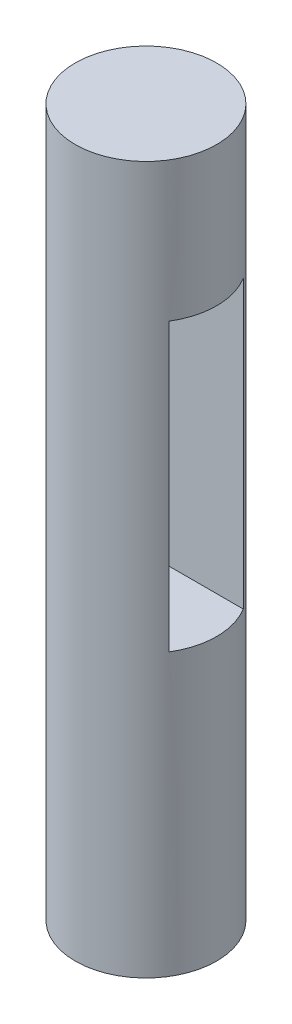
ISO-10303-21;
HEADER;
FILE_DESCRIPTION(('STEP AP214'),'2;1');
FILE_NAME('part.step','',(''),(''),'','','');
FILE_SCHEMA(('AUTOMOTIVE_DESIGN { 1 0 10303 214 1 1 1 1 }'));
ENDSEC;
DATA;
#1=APPLICATION_CONTEXT('core data for automotive mechanical design processes');
#2=APPLICATION_PROTOCOL_DEFINITION('international standard','automotive_design',2000,#1);
#3=PRODUCT_CONTEXT('',#1,'mechanical');
#4=PRODUCT('Part','Part','',(#3));
#5=PRODUCT_RELATED_PRODUCT_CATEGORY('part','',(#4));
#6=PRODUCT_DEFINITION_FORMATION('','',#4);
#7=PRODUCT_DEFINITION_CONTEXT('part definition',#1,'design');
#8=PRODUCT_DEFINITION('design','',#6,#7);
#9=PRODUCT_DEFINITION_SHAPE('','',#8);
#10=(LENGTH_UNIT() NAMED_UNIT(*) SI_UNIT(.MILLI.,.METRE.));
#11=(NAMED_UNIT(*) PLANE_ANGLE_UNIT() SI_UNIT($,.RADIAN.));
#12=(NAMED_UNIT(*) SI_UNIT($,.STERADIAN.) SOLID_ANGLE_UNIT());
#13=UNCERTAINTY_MEASURE_WITH_UNIT(LENGTH_MEASURE(1.E-05),#10,'distance_accuracy_value','');
#14=(GEOMETRIC_REPRESENTATION_CONTEXT(3) GLOBAL_UNCERTAINTY_ASSIGNED_CONTEXT((#13)) GLOBAL_UNIT_ASSIGNED_CONTEXT((#10,
#11,#12)) REPRESENTATION_CONTEXT('',''));
#15=CARTESIAN_POINT('',(0.,0.,0.));
#16=DIRECTION('',(0.,0.,1.));
#17=DIRECTION('',(1.,0.,0.));
#18=AXIS2_PLACEMENT_3D('',#15,#16,#17);
#19=CARTESIAN_POINT('',(0.,50.,0.));
#20=DIRECTION('',(0.,-1.,0.));
#21=DIRECTION('',(0.,0.,-1.));
#22=AXIS2_PLACEMENT_3D('',#19,#20,#21);
#23=CYLINDRICAL_SURFACE('',#22,5.);
#24=DIRECTION('',(0.,-1.,0.));
#25=VECTOR('',#24,1.);
#26=CARTESIAN_POINT('',(-4.2555111326373,50.,-2.625));
#27=LINE('',#26,#25);
#28=CARTESIAN_POINT('',(-4.2555111326373,19.875,-2.625));
#29=VERTEX_POINT('',#28);
#30=CARTESIAN_POINT('',(-4.2555111326373,40.125,-2.625));
#31=VERTEX_POINT('',#30);
#32=EDGE_CURVE('E11',#29,#31,#27,.F.);
#33=ORIENTED_EDGE('',*,*,#32,.T.);
#34=CARTESIAN_POINT('',(0.,40.125,0.));
#35=DIRECTION('',(0.,1.,0.));
#36=DIRECTION('',(0.,0.,1.));
#37=AXIS2_PLACEMENT_3D('',#34,#35,#36);
#38=CIRCLE('',#37,5.);
#39=CARTESIAN_POINT('',(-4.2555111326373,40.125,2.625));
#40=VERTEX_POINT('',#39);
#41=EDGE_CURVE('E70',#31,#40,#38,.T.);
#42=ORIENTED_EDGE('',*,*,#41,.T.);
#43=DIRECTION('',(0.,-1.,0.));
#44=VECTOR('',#43,1.);
#45=CARTESIAN_POINT('',(-4.2555111326373,50.,2.625));
#46=LINE('',#45,#44);
#47=CARTESIAN_POINT('',(-4.2555111326373,19.875,2.625));
#48=VERTEX_POINT('',#47);
#49=EDGE_CURVE('E74',#40,#48,#46,.T.);
#50=ORIENTED_EDGE('',*,*,#49,.T.);
#51=CARTESIAN_POINT('',(0.,19.875,0.));
#52=DIRECTION('',(0.,-1.,0.));
#53=DIRECTION('',(0.,0.,-1.));
#54=AXIS2_PLACEMENT_3D('',#51,#52,#53);
#55=CIRCLE('',#54,5.);
#56=EDGE_CURVE('E40',#48,#29,#55,.T.);
#57=ORIENTED_EDGE('',*,*,#56,.T.);
#58=EDGE_LOOP('',(#33,#42,#50,#57));
#59=FACE_BOUND('',#58,.T.);
#60=DIRECTION('',(0.,-1.,0.));
#61=VECTOR('',#60,1.);
#62=CARTESIAN_POINT('',(4.2555111326373,50.,2.625));
#63=LINE('',#62,#61);
#64=CARTESIAN_POINT('',(4.2555111326373,19.875,2.625));
#65=VERTEX_POINT('',#64);
#66=CARTESIAN_POINT('',(4.2555111326373,40.125,2.625));
#67=VERTEX_POINT('',#66);
#68=EDGE_CURVE('E75',#65,#67,#63,.F.);
#69=ORIENTED_EDGE('',*,*,#68,.T.);
#70=CARTESIAN_POINT('',(4.2555111326373,40.125,-2.625));
#71=VERTEX_POINT('',#70);
#72=EDGE_CURVE('E77',#67,#71,#38,.T.);
#73=ORIENTED_EDGE('',*,*,#72,.T.);
#74=DIRECTION('',(0.,-1.,0.));
#75=VECTOR('',#74,1.);
#76=CARTESIAN_POINT('',(4.2555111326373,50.,-2.625));
#77=LINE('',#76,#75);
#78=CARTESIAN_POINT('',(4.2555111326373,19.875,-2.625));
#79=VERTEX_POINT('',#78);
#80=EDGE_CURVE('E83',#71,#79,#77,.T.);
#81=ORIENTED_EDGE('',*,*,#80,.T.);
#82=EDGE_CURVE('E92',#79,#65,#55,.T.);
#83=ORIENTED_EDGE('',*,*,#82,.T.);
#84=EDGE_LOOP('',(#69,#73,#81,#83));
#85=FACE_BOUND('',#84,.T.);
#86=CARTESIAN_POINT('',(0.,50.,0.));
#87=DIRECTION('',(0.,1.,0.));
#88=DIRECTION('',(0.,0.,1.));
#89=AXIS2_PLACEMENT_3D('',#86,#87,#88);
#90=CIRCLE('',#89,5.);
#91=CARTESIAN_POINT('',(0.,50.,5.));
#92=VERTEX_POINT('',#91);
#93=EDGE_CURVE('E96',#92,#92,#90,.T.);
#94=ORIENTED_EDGE('',*,*,#93,.F.);
#95=EDGE_LOOP('',(#94));
#96=FACE_BOUND('',#95,.T.);
#97=CARTESIAN_POINT('',(0.,0.,0.));
#98=DIRECTION('',(0.,1.,0.));
#99=DIRECTION('',(0.,0.,1.));
#100=AXIS2_PLACEMENT_3D('',#97,#98,#99);
#101=CIRCLE('',#100,5.);
#102=CARTESIAN_POINT('',(0.,0.,5.));
#103=VERTEX_POINT('',#102);
#104=EDGE_CURVE('E98',#103,#103,#101,.T.);
#105=ORIENTED_EDGE('',*,*,#104,.T.);
#106=EDGE_LOOP('',(#105));
#107=FACE_BOUND('',#106,.T.);
#108=ADVANCED_FACE('F33',(#59,#85,#96,#107),#23,.T.);
#109=CARTESIAN_POINT('',(0.,50.,0.));
#110=DIRECTION('',(0.,1.,0.));
#111=DIRECTION('',(0.,0.,1.));
#112=AXIS2_PLACEMENT_3D('',#109,#110,#111);
#113=PLANE('',#112);
#114=ORIENTED_EDGE('',*,*,#93,.T.);
#115=EDGE_LOOP('',(#114));
#116=FACE_BOUND('',#115,.T.);
#117=ADVANCED_FACE('F109',(#116),#113,.T.);
#118=CARTESIAN_POINT('',(0.,0.,0.));
#119=DIRECTION('',(0.,1.,0.));
#120=DIRECTION('',(0.,0.,1.));
#121=AXIS2_PLACEMENT_3D('',#118,#119,#120);
#122=PLANE('',#121);
#123=ORIENTED_EDGE('',*,*,#104,.F.);
#124=EDGE_LOOP('',(#123));
#125=FACE_BOUND('',#124,.T.);
#126=ADVANCED_FACE('F114',(#125),#122,.F.);
#127=CARTESIAN_POINT('',(-5.,19.875,-2.625));
#128=DIRECTION('',(0.,0.,-1.));
#129=DIRECTION('',(-1.,0.,0.));
#130=AXIS2_PLACEMENT_3D('',#127,#128,#129);
#131=PLANE('',#130);
#132=DIRECTION('',(1.,0.,0.));
#133=VECTOR('',#132,1.);
#134=CARTESIAN_POINT('',(-5.,40.125,-2.625));
#135=LINE('',#134,#133);
#136=EDGE_CURVE('E52',#31,#71,#135,.T.);
#137=ORIENTED_EDGE('',*,*,#136,.F.);
#138=ORIENTED_EDGE('',*,*,#32,.F.);
#139=DIRECTION('',(1.,0.,0.));
#140=VECTOR('',#139,1.);
#141=CARTESIAN_POINT('',(-5.,19.875,-2.625));
#142=LINE('',#141,#140);
#143=EDGE_CURVE('E102',#29,#79,#142,.T.);
#144=ORIENTED_EDGE('',*,*,#143,.T.);
#145=ORIENTED_EDGE('',*,*,#80,.F.);
#146=EDGE_LOOP('',(#137,#138,#144,#145));
#147=FACE_BOUND('',#146,.T.);
#148=ADVANCED_FACE('F79',(#147),#131,.F.);
#149=CARTESIAN_POINT('',(-5.,19.875,2.625));
#150=DIRECTION('',(0.,-1.,0.));
#151=DIRECTION('',(0.,0.,-1.));
#152=AXIS2_PLACEMENT_3D('',#149,#150,#151);
#153=PLANE('',#152);
#154=ORIENTED_EDGE('',*,*,#143,.F.);
#155=ORIENTED_EDGE('',*,*,#56,.F.);
#156=DIRECTION('',(1.,0.,0.));
#157=VECTOR('',#156,1.);
#158=CARTESIAN_POINT('',(-5.,19.875,2.625));
#159=LINE('',#158,#157);
#160=EDGE_CURVE('E105',#48,#65,#159,.T.);
#161=ORIENTED_EDGE('',*,*,#160,.T.);
#162=ORIENTED_EDGE('',*,*,#82,.F.);
#163=EDGE_LOOP('',(#154,#155,#161,#162));
#164=FACE_BOUND('',#163,.T.);
#165=ADVANCED_FACE('F120',(#164),#153,.F.);
#166=CARTESIAN_POINT('',(-5.,19.875,2.625));
#167=DIRECTION('',(0.,0.,1.));
#168=DIRECTION('',(1.,0.,0.));
#169=AXIS2_PLACEMENT_3D('',#166,#167,#168);
#170=PLANE('',#169);
#171=DIRECTION('',(1.,0.,0.));
#172=VECTOR('',#171,1.);
#173=CARTESIAN_POINT('',(-5.,40.125,2.625));
#174=LINE('',#173,#172);
#175=EDGE_CURVE('E47',#40,#67,#174,.T.);
#176=ORIENTED_EDGE('',*,*,#175,.T.);
#177=ORIENTED_EDGE('',*,*,#68,.F.);
#178=ORIENTED_EDGE('',*,*,#160,.F.);
#179=ORIENTED_EDGE('',*,*,#49,.F.);
#180=EDGE_LOOP('',(#176,#177,#178,#179));
#181=FACE_BOUND('',#180,.T.);
#182=ADVANCED_FACE('F127',(#181),#170,.F.);
#183=CARTESIAN_POINT('',(-5.,40.125,2.625));
#184=DIRECTION('',(0.,1.,0.));
#185=DIRECTION('',(0.,0.,1.));
#186=AXIS2_PLACEMENT_3D('',#183,#184,#185);
#187=PLANE('',#186);
#188=ORIENTED_EDGE('',*,*,#175,.F.);
#189=ORIENTED_EDGE('',*,*,#41,.F.);
#190=ORIENTED_EDGE('',*,*,#136,.T.);
#191=ORIENTED_EDGE('',*,*,#72,.F.);
#192=EDGE_LOOP('',(#188,#189,#190,#191));
#193=FACE_BOUND('',#192,.T.);
#194=ADVANCED_FACE('F71',(#193),#187,.F.);
#195=CLOSED_SHELL('',(#108,#117,#126,#148,#165,#182,#194));
#196=MANIFOLD_SOLID_BREP('B2',#195);
#197=ADVANCED_BREP_SHAPE_REPRESENTATION('',(#18,#196),#14);
#198=SHAPE_DEFINITION_REPRESENTATION(#9,#197);
ENDSEC;
END-ISO-10303-21;
